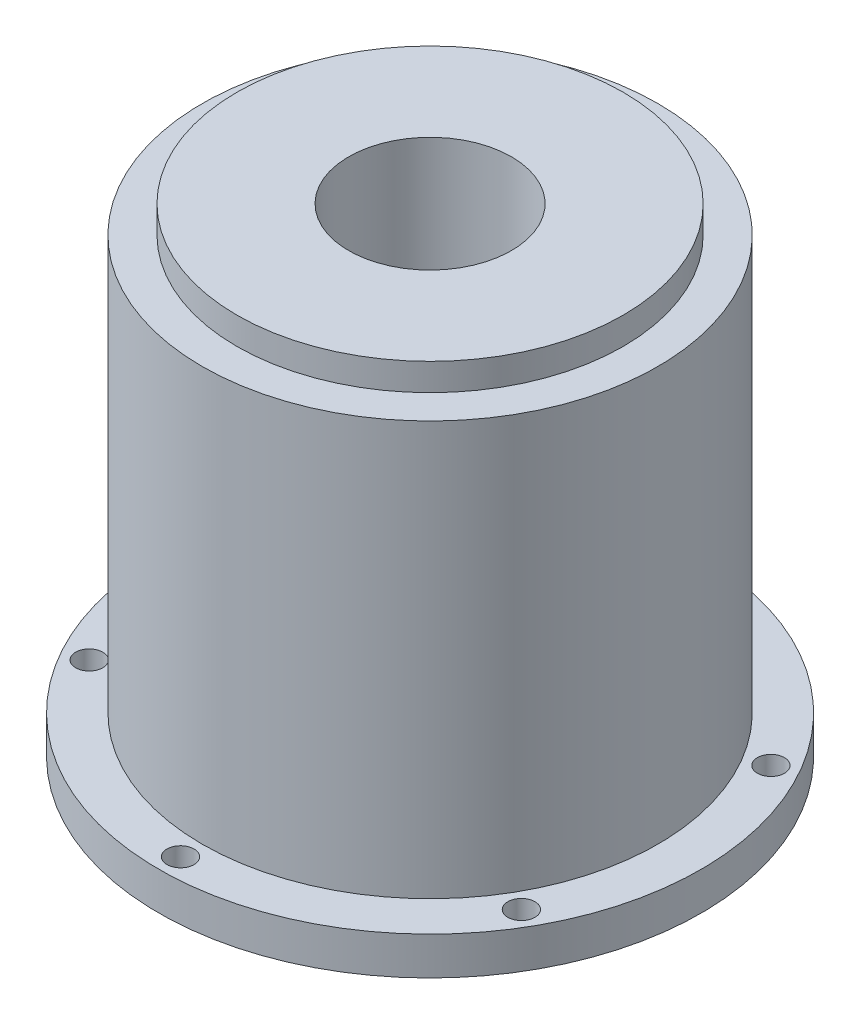
ISO-10303-21;
HEADER;
FILE_DESCRIPTION(('STEP AP214'),'2;1');
FILE_NAME('part.step','',(''),(''),'','','');
FILE_SCHEMA(('AUTOMOTIVE_DESIGN { 1 0 10303 214 1 1 1 1 }'));
ENDSEC;
DATA;
#1=APPLICATION_CONTEXT('core data for automotive mechanical design processes');
#2=APPLICATION_PROTOCOL_DEFINITION('international standard','automotive_design',2000,#1);
#3=PRODUCT_CONTEXT('',#1,'mechanical');
#4=PRODUCT('Part','Part','',(#3));
#5=PRODUCT_RELATED_PRODUCT_CATEGORY('part','',(#4));
#6=PRODUCT_DEFINITION_FORMATION('','',#4);
#7=PRODUCT_DEFINITION_CONTEXT('part definition',#1,'design');
#8=PRODUCT_DEFINITION('design','',#6,#7);
#9=PRODUCT_DEFINITION_SHAPE('','',#8);
#10=(LENGTH_UNIT() NAMED_UNIT(*) SI_UNIT(.MILLI.,.METRE.));
#11=(NAMED_UNIT(*) PLANE_ANGLE_UNIT() SI_UNIT($,.RADIAN.));
#12=(NAMED_UNIT(*) SI_UNIT($,.STERADIAN.) SOLID_ANGLE_UNIT());
#13=UNCERTAINTY_MEASURE_WITH_UNIT(LENGTH_MEASURE(1.E-05),#10,'distance_accuracy_value','');
#14=(GEOMETRIC_REPRESENTATION_CONTEXT(3) GLOBAL_UNCERTAINTY_ASSIGNED_CONTEXT((#13)) GLOBAL_UNIT_ASSIGNED_CONTEXT((#10,
#11,#12)) REPRESENTATION_CONTEXT('',''));
#15=CARTESIAN_POINT('',(0.,0.,0.));
#16=DIRECTION('',(0.,0.,1.));
#17=DIRECTION('',(1.,0.,0.));
#18=AXIS2_PLACEMENT_3D('',#15,#16,#17);
#19=CARTESIAN_POINT('',(0.,0.,0.));
#20=DIRECTION('',(0.,-1.,0.));
#21=DIRECTION('',(0.,0.,-1.));
#22=AXIS2_PLACEMENT_3D('',#19,#20,#21);
#23=CYLINDRICAL_SURFACE('',#22,8.7);
#24=CARTESIAN_POINT('',(0.,12.5168878123584,0.));
#25=DIRECTION('',(0.,-1.,0.));
#26=DIRECTION('',(0.,0.,-1.));
#27=AXIS2_PLACEMENT_3D('',#24,#25,#26);
#28=CIRCLE('',#27,8.7);
#29=CARTESIAN_POINT('',(0.,12.5168878123584,-8.7));
#30=VERTEX_POINT('',#29);
#31=EDGE_CURVE('E10',#30,#30,#28,.T.);
#32=ORIENTED_EDGE('',*,*,#31,.F.);
#33=EDGE_LOOP('',(#32));
#34=FACE_BOUND('',#33,.T.);
#35=CARTESIAN_POINT('',(0.,53.5218762730606,0.));
#36=DIRECTION('',(0.,-1.,0.));
#37=DIRECTION('',(0.,0.,-1.));
#38=AXIS2_PLACEMENT_3D('',#35,#36,#37);
#39=CIRCLE('',#38,8.7);
#40=CARTESIAN_POINT('',(0.,53.5218762730606,-8.7));
#41=VERTEX_POINT('',#40);
#42=EDGE_CURVE('E126',#41,#41,#39,.T.);
#43=ORIENTED_EDGE('',*,*,#42,.T.);
#44=EDGE_LOOP('',(#43));
#45=FACE_BOUND('',#44,.T.);
#46=ADVANCED_FACE('F37',(#34,#45),#23,.T.);
#47=CARTESIAN_POINT('',(13.1137702264527,12.5168878123584,0.));
#48=DIRECTION('',(0.,-1.,0.));
#49=DIRECTION('',(0.,0.,-1.));
#50=AXIS2_PLACEMENT_3D('',#47,#48,#49);
#51=PLANE('',#50);
#52=CARTESIAN_POINT('',(0.,12.5168878123584,-11.));
#53=DIRECTION('',(0.,1.,0.));
#54=DIRECTION('',(0.,0.,1.));
#55=AXIS2_PLACEMENT_3D('',#52,#53,#54);
#56=CIRCLE('',#55,1.25);
#57=CARTESIAN_POINT('',(0.,12.5168878123584,-9.75));
#58=VERTEX_POINT('',#57);
#59=EDGE_CURVE('E261',#58,#58,#56,.T.);
#60=ORIENTED_EDGE('',*,*,#59,.F.);
#61=EDGE_LOOP('',(#60));
#62=FACE_BOUND('',#61,.T.);
#63=CARTESIAN_POINT('',(-9.52627944162852,12.5168878123584,-5.49999999999945));
#64=DIRECTION('',(0.,1.,0.));
#65=DIRECTION('',(0.,0.,1.));
#66=AXIS2_PLACEMENT_3D('',#63,#64,#65);
#67=CIRCLE('',#66,1.25000000000059);
#68=CARTESIAN_POINT('',(-9.52627944162852,12.5168878123584,-4.24999999999887));
#69=VERTEX_POINT('',#68);
#70=EDGE_CURVE('E275',#69,#69,#67,.T.);
#71=ORIENTED_EDGE('',*,*,#70,.F.);
#72=EDGE_LOOP('',(#71));
#73=FACE_BOUND('',#72,.T.);
#74=CARTESIAN_POINT('',(-9.52627944162789,12.5168878123584,5.50000000000054));
#75=DIRECTION('',(0.,1.,0.));
#76=DIRECTION('',(0.,0.,1.));
#77=AXIS2_PLACEMENT_3D('',#74,#75,#76);
#78=CIRCLE('',#77,1.25000000000115);
#79=CARTESIAN_POINT('',(-9.52627944162789,12.5168878123584,6.7500000000017));
#80=VERTEX_POINT('',#79);
#81=EDGE_CURVE('E278',#80,#80,#78,.T.);
#82=ORIENTED_EDGE('',*,*,#81,.F.);
#83=EDGE_LOOP('',(#82));
#84=FACE_BOUND('',#83,.T.);
#85=CARTESIAN_POINT('',(1.24786099197965E-12,12.5168878123584,11.));
#86=DIRECTION('',(0.,1.,0.));
#87=DIRECTION('',(0.,0.,1.));
#88=AXIS2_PLACEMENT_3D('',#85,#86,#87);
#89=CIRCLE('',#88,1.25000000000127);
#90=CARTESIAN_POINT('',(1.24786099197965E-12,12.5168878123584,12.2500000000013));
#91=VERTEX_POINT('',#90);
#92=EDGE_CURVE('E283',#91,#91,#89,.T.);
#93=ORIENTED_EDGE('',*,*,#92,.F.);
#94=EDGE_LOOP('',(#93));
#95=FACE_BOUND('',#94,.T.);
#96=CARTESIAN_POINT('',(9.52627944162976,12.5168878123584,5.49999999999946));
#97=DIRECTION('',(0.,1.,0.));
#98=DIRECTION('',(0.,0.,1.));
#99=AXIS2_PLACEMENT_3D('',#96,#97,#98);
#100=CIRCLE('',#99,1.25000000000079);
#101=CARTESIAN_POINT('',(9.52627944162976,12.5168878123584,6.75000000000025));
#102=VERTEX_POINT('',#101);
#103=EDGE_CURVE('E272',#102,#102,#100,.T.);
#104=ORIENTED_EDGE('',*,*,#103,.F.);
#105=EDGE_LOOP('',(#104));
#106=FACE_BOUND('',#105,.T.);
#107=CARTESIAN_POINT('',(9.52627944162914,12.5168878123584,-5.50000000000054));
#108=DIRECTION('',(0.,1.,0.));
#109=DIRECTION('',(0.,0.,1.));
#110=AXIS2_PLACEMENT_3D('',#107,#108,#109);
#111=CIRCLE('',#110,1.25000000000016);
#112=CARTESIAN_POINT('',(9.52627944162914,12.5168878123584,-4.25000000000038));
#113=VERTEX_POINT('',#112);
#114=EDGE_CURVE('E264',#113,#113,#111,.T.);
#115=ORIENTED_EDGE('',*,*,#114,.F.);
#116=EDGE_LOOP('',(#115));
#117=FACE_BOUND('',#116,.T.);
#118=CARTESIAN_POINT('',(0.,12.5168878123584,0.));
#119=DIRECTION('',(0.,-1.,0.));
#120=DIRECTION('',(0.,0.,-1.));
#121=AXIS2_PLACEMENT_3D('',#118,#119,#120);
#122=CIRCLE('',#121,13.1137702264527);
#123=CARTESIAN_POINT('',(0.,12.5168878123584,-13.1137702264527));
#124=VERTEX_POINT('',#123);
#125=EDGE_CURVE('E45',#124,#124,#122,.T.);
#126=ORIENTED_EDGE('',*,*,#125,.F.);
#127=EDGE_LOOP('',(#126));
#128=FACE_BOUND('',#127,.T.);
#129=ORIENTED_EDGE('',*,*,#31,.T.);
#130=EDGE_LOOP('',(#129));
#131=FACE_BOUND('',#130,.T.);
#132=ADVANCED_FACE('F146',(#62,#73,#84,#95,#106,#117,#128,#131),#51,.F.);
#133=CARTESIAN_POINT('',(0.,0.,0.));
#134=DIRECTION('',(0.,-1.,0.));
#135=DIRECTION('',(0.,0.,-1.));
#136=AXIS2_PLACEMENT_3D('',#133,#134,#135);
#137=CYLINDRICAL_SURFACE('',#136,13.1137702264527);
#138=CARTESIAN_POINT('',(0.,15.9319356508298,0.));
#139=DIRECTION('',(0.,-1.,0.));
#140=DIRECTION('',(0.,0.,-1.));
#141=AXIS2_PLACEMENT_3D('',#138,#139,#140);
#142=CIRCLE('',#141,13.1137702264527);
#143=CARTESIAN_POINT('',(0.,15.9319356508298,-13.1137702264527));
#144=VERTEX_POINT('',#143);
#145=EDGE_CURVE('E51',#144,#144,#142,.T.);
#146=ORIENTED_EDGE('',*,*,#145,.F.);
#147=EDGE_LOOP('',(#146));
#148=FACE_BOUND('',#147,.T.);
#149=ORIENTED_EDGE('',*,*,#125,.T.);
#150=EDGE_LOOP('',(#149));
#151=FACE_BOUND('',#150,.T.);
#152=ADVANCED_FACE('F143',(#148,#151),#137,.F.);
#153=CARTESIAN_POINT('',(19.6,15.9319356508298,0.));
#154=DIRECTION('',(0.,-1.,0.));
#155=DIRECTION('',(0.,0.,-1.));
#156=AXIS2_PLACEMENT_3D('',#153,#154,#155);
#157=PLANE('',#156);
#158=CARTESIAN_POINT('',(0.,15.9319356508298,0.));
#159=DIRECTION('',(0.,-1.,0.));
#160=DIRECTION('',(0.,0.,-1.));
#161=AXIS2_PLACEMENT_3D('',#158,#159,#160);
#162=CIRCLE('',#161,19.6);
#163=CARTESIAN_POINT('',(0.,15.9319356508298,-19.6));
#164=VERTEX_POINT('',#163);
#165=EDGE_CURVE('E134',#164,#164,#162,.T.);
#166=ORIENTED_EDGE('',*,*,#165,.F.);
#167=EDGE_LOOP('',(#166));
#168=FACE_BOUND('',#167,.T.);
#169=ORIENTED_EDGE('',*,*,#145,.T.);
#170=EDGE_LOOP('',(#169));
#171=FACE_BOUND('',#170,.T.);
#172=ADVANCED_FACE('F141',(#168,#171),#157,.F.);
#173=CARTESIAN_POINT('',(0.,0.,0.));
#174=DIRECTION('',(0.,-1.,0.));
#175=DIRECTION('',(0.,0.,-1.));
#176=AXIS2_PLACEMENT_3D('',#173,#174,#175);
#177=CYLINDRICAL_SURFACE('',#176,19.6);
#178=CARTESIAN_POINT('',(0.,53.5218762730606,0.));
#179=DIRECTION('',(0.,-1.,0.));
#180=DIRECTION('',(0.,0.,-1.));
#181=AXIS2_PLACEMENT_3D('',#178,#179,#180);
#182=CIRCLE('',#181,19.6);
#183=CARTESIAN_POINT('',(0.,53.5218762730606,-19.6));
#184=VERTEX_POINT('',#183);
#185=EDGE_CURVE('E130',#184,#184,#182,.T.);
#186=ORIENTED_EDGE('',*,*,#185,.F.);
#187=EDGE_LOOP('',(#186));
#188=FACE_BOUND('',#187,.T.);
#189=ORIENTED_EDGE('',*,*,#165,.T.);
#190=EDGE_LOOP('',(#189));
#191=FACE_BOUND('',#190,.T.);
#192=ADVANCED_FACE('F161',(#188,#191),#177,.F.);
#193=CARTESIAN_POINT('',(8.7,53.5218762730606,0.));
#194=DIRECTION('',(0.,1.,0.));
#195=DIRECTION('',(0.,0.,1.));
#196=AXIS2_PLACEMENT_3D('',#193,#194,#195);
#197=PLANE('',#196);
#198=ORIENTED_EDGE('',*,*,#42,.F.);
#199=EDGE_LOOP('',(#198));
#200=FACE_BOUND('',#199,.T.);
#201=ORIENTED_EDGE('',*,*,#185,.T.);
#202=EDGE_LOOP('',(#201));
#203=FACE_BOUND('',#202,.T.);
#204=ADVANCED_FACE('F165',(#200,#203),#197,.F.);
#205=CARTESIAN_POINT('',(9.52627944162914,2.5168878123584,-5.50000000000054));
#206=DIRECTION('',(0.,1.,0.));
#207=DIRECTION('',(0.,0.,1.));
#208=AXIS2_PLACEMENT_3D('',#205,#206,#207);
#209=CYLINDRICAL_SURFACE('',#208,1.25000000000016);
#210=CARTESIAN_POINT('',(9.52627944162914,7.22187627306058,-5.50000000000054));
#211=DIRECTION('',(0.,-1.,0.));
#212=DIRECTION('',(0.,0.,-1.));
#213=AXIS2_PLACEMENT_3D('',#210,#211,#212);
#214=CIRCLE('',#213,1.25000000000016);
#215=CARTESIAN_POINT('',(9.52627944162914,7.22187627306058,-6.75000000000071));
#216=VERTEX_POINT('',#215);
#217=EDGE_CURVE('E263',#216,#216,#214,.T.);
#218=ORIENTED_EDGE('',*,*,#217,.T.);
#219=EDGE_LOOP('',(#218));
#220=FACE_BOUND('',#219,.T.);
#221=ORIENTED_EDGE('',*,*,#114,.T.);
#222=EDGE_LOOP('',(#221));
#223=FACE_BOUND('',#222,.T.);
#224=ADVANCED_FACE('F169',(#220,#223),#209,.F.);
#225=CARTESIAN_POINT('',(9.52627944162976,2.5168878123584,5.49999999999946));
#226=DIRECTION('',(0.,1.,0.));
#227=DIRECTION('',(0.,0.,1.));
#228=AXIS2_PLACEMENT_3D('',#225,#226,#227);
#229=CYLINDRICAL_SURFACE('',#228,1.25000000000079);
#230=CARTESIAN_POINT('',(9.52627944162976,7.22187627306058,5.49999999999946));
#231=DIRECTION('',(0.,-1.,0.));
#232=DIRECTION('',(0.,0.,-1.));
#233=AXIS2_PLACEMENT_3D('',#230,#231,#232);
#234=CIRCLE('',#233,1.25000000000079);
#235=CARTESIAN_POINT('',(9.52627944162976,7.22187627306058,4.24999999999867));
#236=VERTEX_POINT('',#235);
#237=EDGE_CURVE('E269',#236,#236,#234,.T.);
#238=ORIENTED_EDGE('',*,*,#237,.T.);
#239=EDGE_LOOP('',(#238));
#240=FACE_BOUND('',#239,.T.);
#241=ORIENTED_EDGE('',*,*,#103,.T.);
#242=EDGE_LOOP('',(#241));
#243=FACE_BOUND('',#242,.T.);
#244=ADVANCED_FACE('F241',(#240,#243),#229,.F.);
#245=CARTESIAN_POINT('',(1.24786099197965E-12,2.5168878123584,11.));
#246=DIRECTION('',(0.,1.,0.));
#247=DIRECTION('',(0.,0.,1.));
#248=AXIS2_PLACEMENT_3D('',#245,#246,#247);
#249=CYLINDRICAL_SURFACE('',#248,1.25000000000127);
#250=CARTESIAN_POINT('',(1.24786099197965E-12,7.22187627306058,11.));
#251=DIRECTION('',(0.,-1.,0.));
#252=DIRECTION('',(0.,0.,-1.));
#253=AXIS2_PLACEMENT_3D('',#250,#251,#252);
#254=CIRCLE('',#253,1.25000000000127);
#255=CARTESIAN_POINT('',(1.24786099197965E-12,7.22187627306058,9.74999999999873));
#256=VERTEX_POINT('',#255);
#257=EDGE_CURVE('E293',#256,#256,#254,.T.);
#258=ORIENTED_EDGE('',*,*,#257,.T.);
#259=EDGE_LOOP('',(#258));
#260=FACE_BOUND('',#259,.T.);
#261=ORIENTED_EDGE('',*,*,#92,.T.);
#262=EDGE_LOOP('',(#261));
#263=FACE_BOUND('',#262,.T.);
#264=ADVANCED_FACE('F237',(#260,#263),#249,.F.);
#265=CARTESIAN_POINT('',(-9.52627944162789,2.5168878123584,5.50000000000054));
#266=DIRECTION('',(0.,1.,0.));
#267=DIRECTION('',(0.,0.,1.));
#268=AXIS2_PLACEMENT_3D('',#265,#266,#267);
#269=CYLINDRICAL_SURFACE('',#268,1.25000000000115);
#270=CARTESIAN_POINT('',(-9.52627944162789,7.22187627306058,5.50000000000054));
#271=DIRECTION('',(0.,-1.,0.));
#272=DIRECTION('',(0.,0.,-1.));
#273=AXIS2_PLACEMENT_3D('',#270,#271,#272);
#274=CIRCLE('',#273,1.25000000000115);
#275=CARTESIAN_POINT('',(-9.52627944162789,7.22187627306058,4.24999999999939));
#276=VERTEX_POINT('',#275);
#277=EDGE_CURVE('E297',#276,#276,#274,.T.);
#278=ORIENTED_EDGE('',*,*,#277,.T.);
#279=EDGE_LOOP('',(#278));
#280=FACE_BOUND('',#279,.T.);
#281=ORIENTED_EDGE('',*,*,#81,.T.);
#282=EDGE_LOOP('',(#281));
#283=FACE_BOUND('',#282,.T.);
#284=ADVANCED_FACE('F233',(#280,#283),#269,.F.);
#285=CARTESIAN_POINT('',(-9.52627944162852,2.5168878123584,-5.49999999999945));
#286=DIRECTION('',(0.,1.,0.));
#287=DIRECTION('',(0.,0.,1.));
#288=AXIS2_PLACEMENT_3D('',#285,#286,#287);
#289=CYLINDRICAL_SURFACE('',#288,1.25000000000059);
#290=CARTESIAN_POINT('',(-9.52627944162852,7.22187627306058,-5.49999999999945));
#291=DIRECTION('',(0.,-1.,0.));
#292=DIRECTION('',(0.,0.,-1.));
#293=AXIS2_PLACEMENT_3D('',#290,#291,#292);
#294=CIRCLE('',#293,1.25000000000059);
#295=CARTESIAN_POINT('',(-9.52627944162852,7.22187627306058,-6.75000000000004));
#296=VERTEX_POINT('',#295);
#297=EDGE_CURVE('E301',#296,#296,#294,.T.);
#298=ORIENTED_EDGE('',*,*,#297,.T.);
#299=EDGE_LOOP('',(#298));
#300=FACE_BOUND('',#299,.T.);
#301=ORIENTED_EDGE('',*,*,#70,.T.);
#302=EDGE_LOOP('',(#301));
#303=FACE_BOUND('',#302,.T.);
#304=ADVANCED_FACE('F236',(#300,#303),#289,.F.);
#305=CARTESIAN_POINT('',(0.,2.5168878123584,-11.));
#306=DIRECTION('',(0.,1.,0.));
#307=DIRECTION('',(0.,0.,1.));
#308=AXIS2_PLACEMENT_3D('',#305,#306,#307);
#309=CYLINDRICAL_SURFACE('',#308,1.25);
#310=CARTESIAN_POINT('',(0.,7.22187627306058,-11.));
#311=DIRECTION('',(0.,-1.,0.));
#312=DIRECTION('',(0.,0.,-1.));
#313=AXIS2_PLACEMENT_3D('',#310,#311,#312);
#314=CIRCLE('',#313,1.25);
#315=CARTESIAN_POINT('',(0.,7.22187627306058,-12.25));
#316=VERTEX_POINT('',#315);
#317=EDGE_CURVE('E259',#316,#316,#314,.T.);
#318=ORIENTED_EDGE('',*,*,#317,.T.);
#319=EDGE_LOOP('',(#318));
#320=FACE_BOUND('',#319,.T.);
#321=ORIENTED_EDGE('',*,*,#59,.T.);
#322=EDGE_LOOP('',(#321));
#323=FACE_BOUND('',#322,.T.);
#324=ADVANCED_FACE('F175',(#320,#323),#309,.F.);
#325=CARTESIAN_POINT('',(7.5,57.8218762730606,0.));
#326=DIRECTION('',(0.,1.,0.));
#327=DIRECTION('',(0.,0.,1.));
#328=AXIS2_PLACEMENT_3D('',#325,#326,#327);
#329=PLANE('',#328);
#330=CARTESIAN_POINT('',(0.,57.8218762730606,0.));
#331=DIRECTION('',(0.,-1.,0.));
#332=DIRECTION('',(0.,0.,-1.));
#333=AXIS2_PLACEMENT_3D('',#330,#331,#332);
#334=CIRCLE('',#333,7.5);
#335=CARTESIAN_POINT('',(0.,57.8218762730606,-7.5));
#336=VERTEX_POINT('',#335);
#337=EDGE_CURVE('E78',#336,#336,#334,.T.);
#338=ORIENTED_EDGE('',*,*,#337,.T.);
#339=EDGE_LOOP('',(#338));
#340=FACE_BOUND('',#339,.T.);
#341=CARTESIAN_POINT('',(0.,57.8218762730606,0.));
#342=DIRECTION('',(0.,-1.,0.));
#343=DIRECTION('',(0.,0.,-1.));
#344=AXIS2_PLACEMENT_3D('',#341,#342,#343);
#345=CIRCLE('',#344,17.8017670559084);
#346=CARTESIAN_POINT('',(0.,57.8218762730606,-17.8017670559084));
#347=VERTEX_POINT('',#346);
#348=EDGE_CURVE('E122',#347,#347,#345,.T.);
#349=ORIENTED_EDGE('',*,*,#348,.F.);
#350=EDGE_LOOP('',(#349));
#351=FACE_BOUND('',#350,.T.);
#352=ADVANCED_FACE('F171',(#340,#351),#329,.T.);
#353=CARTESIAN_POINT('',(0.,0.,0.));
#354=DIRECTION('',(0.,-1.,0.));
#355=DIRECTION('',(0.,0.,-1.));
#356=AXIS2_PLACEMENT_3D('',#353,#354,#355);
#357=CYLINDRICAL_SURFACE('',#356,17.8017670559084);
#358=ORIENTED_EDGE('',*,*,#348,.T.);
#359=EDGE_LOOP('',(#358));
#360=FACE_BOUND('',#359,.T.);
#361=CARTESIAN_POINT('',(0.,55.3218762730606,0.));
#362=DIRECTION('',(0.,-1.,0.));
#363=DIRECTION('',(0.,0.,-1.));
#364=AXIS2_PLACEMENT_3D('',#361,#362,#363);
#365=CIRCLE('',#364,17.8017670559084);
#366=CARTESIAN_POINT('',(0.,55.3218762730606,-17.8017670559084));
#367=VERTEX_POINT('',#366);
#368=EDGE_CURVE('E118',#367,#367,#365,.T.);
#369=ORIENTED_EDGE('',*,*,#368,.F.);
#370=EDGE_LOOP('',(#369));
#371=FACE_BOUND('',#370,.T.);
#372=ADVANCED_FACE('F174',(#360,#371),#357,.T.);
#373=CARTESIAN_POINT('',(17.8017670559084,55.3218762730606,0.));
#374=DIRECTION('',(0.,1.,0.));
#375=DIRECTION('',(0.,0.,1.));
#376=AXIS2_PLACEMENT_3D('',#373,#374,#375);
#377=PLANE('',#376);
#378=ORIENTED_EDGE('',*,*,#368,.T.);
#379=EDGE_LOOP('',(#378));
#380=FACE_BOUND('',#379,.T.);
#381=CARTESIAN_POINT('',(0.,55.3218762730606,0.));
#382=DIRECTION('',(0.,-1.,0.));
#383=DIRECTION('',(0.,0.,-1.));
#384=AXIS2_PLACEMENT_3D('',#381,#382,#383);
#385=CIRCLE('',#384,21.);
#386=CARTESIAN_POINT('',(0.,55.3218762730606,-21.));
#387=VERTEX_POINT('',#386);
#388=EDGE_CURVE('E114',#387,#387,#385,.T.);
#389=ORIENTED_EDGE('',*,*,#388,.F.);
#390=EDGE_LOOP('',(#389));
#391=FACE_BOUND('',#390,.T.);
#392=ADVANCED_FACE('F178',(#380,#391),#377,.T.);
#393=CARTESIAN_POINT('',(0.,0.,0.));
#394=DIRECTION('',(0.,-1.,0.));
#395=DIRECTION('',(0.,0.,-1.));
#396=AXIS2_PLACEMENT_3D('',#393,#394,#395);
#397=CYLINDRICAL_SURFACE('',#396,21.);
#398=ORIENTED_EDGE('',*,*,#388,.T.);
#399=EDGE_LOOP('',(#398));
#400=FACE_BOUND('',#399,.T.);
#401=CARTESIAN_POINT('',(0.,17.1864239426177,0.));
#402=DIRECTION('',(0.,-1.,0.));
#403=DIRECTION('',(0.,0.,-1.));
#404=AXIS2_PLACEMENT_3D('',#401,#402,#403);
#405=CIRCLE('',#404,21.);
#406=CARTESIAN_POINT('',(0.,17.1864239426177,-21.));
#407=VERTEX_POINT('',#406);
#408=EDGE_CURVE('E110',#407,#407,#405,.T.);
#409=ORIENTED_EDGE('',*,*,#408,.F.);
#410=EDGE_LOOP('',(#409));
#411=FACE_BOUND('',#410,.T.);
#412=ADVANCED_FACE('F182',(#400,#411),#397,.T.);
#413=CARTESIAN_POINT('',(21.,17.1864239426177,0.));
#414=DIRECTION('',(0.,1.,0.));
#415=DIRECTION('',(0.,0.,1.));
#416=AXIS2_PLACEMENT_3D('',#413,#414,#415);
#417=PLANE('',#416);
#418=CARTESIAN_POINT('',(0.,17.1864239426177,-23.));
#419=DIRECTION('',(0.,1.,0.));
#420=DIRECTION('',(0.,0.,1.));
#421=AXIS2_PLACEMENT_3D('',#418,#419,#420);
#422=CIRCLE('',#421,1.25);
#423=CARTESIAN_POINT('',(0.,17.1864239426177,-21.75));
#424=VERTEX_POINT('',#423);
#425=EDGE_CURVE('E60',#424,#424,#422,.T.);
#426=ORIENTED_EDGE('',*,*,#425,.F.);
#427=EDGE_LOOP('',(#426));
#428=FACE_BOUND('',#427,.T.);
#429=CARTESIAN_POINT('',(-19.9185842870405,17.1864239426177,-11.4999999999972));
#430=DIRECTION('',(0.,1.,0.));
#431=DIRECTION('',(0.,0.,1.));
#432=AXIS2_PLACEMENT_3D('',#429,#430,#431);
#433=CIRCLE('',#432,1.25000000000266);
#434=CARTESIAN_POINT('',(-19.9185842870405,17.1864239426177,-10.2499999999945));
#435=VERTEX_POINT('',#434);
#436=EDGE_CURVE('E307',#435,#435,#433,.T.);
#437=ORIENTED_EDGE('',*,*,#436,.F.);
#438=EDGE_LOOP('',(#437));
#439=FACE_BOUND('',#438,.T.);
#440=CARTESIAN_POINT('',(-19.9185842870372,17.1864239426177,11.5000000000028));
#441=DIRECTION('',(0.,1.,0.));
#442=DIRECTION('',(0.,0.,1.));
#443=AXIS2_PLACEMENT_3D('',#440,#441,#442);
#444=CIRCLE('',#443,1.25000000000572);
#445=CARTESIAN_POINT('',(-19.9185842870372,17.1864239426177,12.7500000000086));
#446=VERTEX_POINT('',#445);
#447=EDGE_CURVE('E92',#446,#446,#444,.T.);
#448=ORIENTED_EDGE('',*,*,#447,.F.);
#449=EDGE_LOOP('',(#448));
#450=FACE_BOUND('',#449,.T.);
#451=CARTESIAN_POINT('',(6.53135979371684E-12,17.1864239426177,23.));
#452=DIRECTION('',(0.,1.,0.));
#453=DIRECTION('',(0.,0.,1.));
#454=AXIS2_PLACEMENT_3D('',#451,#452,#453);
#455=CIRCLE('',#454,1.2500000000064);
#456=CARTESIAN_POINT('',(6.53135979371684E-12,17.1864239426177,24.2500000000064));
#457=VERTEX_POINT('',#456);
#458=EDGE_CURVE('E321',#457,#457,#455,.T.);
#459=ORIENTED_EDGE('',*,*,#458,.F.);
#460=EDGE_LOOP('',(#459));
#461=FACE_BOUND('',#460,.T.);
#462=CARTESIAN_POINT('',(19.918584287047,17.1864239426177,11.4999999999972));
#463=DIRECTION('',(0.,1.,0.));
#464=DIRECTION('',(0.,0.,1.));
#465=AXIS2_PLACEMENT_3D('',#462,#463,#464);
#466=CIRCLE('',#465,1.25000000000396);
#467=CARTESIAN_POINT('',(19.918584287047,17.1864239426177,12.7500000000011));
#468=VERTEX_POINT('',#467);
#469=EDGE_CURVE('E318',#468,#468,#466,.T.);
#470=ORIENTED_EDGE('',*,*,#469,.F.);
#471=EDGE_LOOP('',(#470));
#472=FACE_BOUND('',#471,.T.);
#473=CARTESIAN_POINT('',(19.9185842870437,17.1864239426177,-11.5000000000028));
#474=DIRECTION('',(0.,1.,0.));
#475=DIRECTION('',(0.,0.,1.));
#476=AXIS2_PLACEMENT_3D('',#473,#474,#475);
#477=CIRCLE('',#476,1.25000000000079);
#478=CARTESIAN_POINT('',(19.9185842870437,17.1864239426177,-10.250000000002));
#479=VERTEX_POINT('',#478);
#480=EDGE_CURVE('E311',#479,#479,#477,.T.);
#481=ORIENTED_EDGE('',*,*,#480,.F.);
#482=EDGE_LOOP('',(#481));
#483=FACE_BOUND('',#482,.T.);
#484=ORIENTED_EDGE('',*,*,#408,.T.);
#485=EDGE_LOOP('',(#484));
#486=FACE_BOUND('',#485,.T.);
#487=CARTESIAN_POINT('',(0.,17.1864239426177,0.));
#488=DIRECTION('',(0.,-1.,0.));
#489=DIRECTION('',(0.,0.,-1.));
#490=AXIS2_PLACEMENT_3D('',#487,#488,#489);
#491=CIRCLE('',#490,25.);
#492=CARTESIAN_POINT('',(0.,17.1864239426177,-25.));
#493=VERTEX_POINT('',#492);
#494=EDGE_CURVE('E106',#493,#493,#491,.T.);
#495=ORIENTED_EDGE('',*,*,#494,.F.);
#496=EDGE_LOOP('',(#495));
#497=FACE_BOUND('',#496,.T.);
#498=ADVANCED_FACE('F186',(#428,#439,#450,#461,#472,#483,#486,#497),#417,.T.);
#499=CARTESIAN_POINT('',(0.,0.,0.));
#500=DIRECTION('',(0.,-1.,0.));
#501=DIRECTION('',(0.,0.,-1.));
#502=AXIS2_PLACEMENT_3D('',#499,#500,#501);
#503=CYLINDRICAL_SURFACE('',#502,25.);
#504=ORIENTED_EDGE('',*,*,#494,.T.);
#505=EDGE_LOOP('',(#504));
#506=FACE_BOUND('',#505,.T.);
#507=CARTESIAN_POINT('',(0.,13.6864239426177,0.));
#508=DIRECTION('',(0.,-1.,0.));
#509=DIRECTION('',(0.,0.,-1.));
#510=AXIS2_PLACEMENT_3D('',#507,#508,#509);
#511=CIRCLE('',#510,25.);
#512=CARTESIAN_POINT('',(0.,13.6864239426177,-25.));
#513=VERTEX_POINT('',#512);
#514=EDGE_CURVE('E102',#513,#513,#511,.T.);
#515=ORIENTED_EDGE('',*,*,#514,.F.);
#516=EDGE_LOOP('',(#515));
#517=FACE_BOUND('',#516,.T.);
#518=ADVANCED_FACE('F190',(#506,#517),#503,.T.);
#519=CARTESIAN_POINT('',(25.,13.6864239426177,0.));
#520=DIRECTION('',(0.,-1.,0.));
#521=DIRECTION('',(0.,0.,-1.));
#522=AXIS2_PLACEMENT_3D('',#519,#520,#521);
#523=PLANE('',#522);
#524=CARTESIAN_POINT('',(0.,13.6864239426177,-23.));
#525=DIRECTION('',(0.,-1.,0.));
#526=DIRECTION('',(0.,0.,-1.));
#527=AXIS2_PLACEMENT_3D('',#524,#525,#526);
#528=CIRCLE('',#527,1.25);
#529=CARTESIAN_POINT('',(0.,13.6864239426177,-24.25));
#530=VERTEX_POINT('',#529);
#531=EDGE_CURVE('E40',#530,#530,#528,.T.);
#532=ORIENTED_EDGE('',*,*,#531,.F.);
#533=EDGE_LOOP('',(#532));
#534=FACE_BOUND('',#533,.T.);
#535=CARTESIAN_POINT('',(-19.9185842870405,13.6864239426177,-11.4999999999972));
#536=DIRECTION('',(0.,-1.,0.));
#537=DIRECTION('',(0.,0.,-1.));
#538=AXIS2_PLACEMENT_3D('',#535,#536,#537);
#539=CIRCLE('',#538,1.25000000000266);
#540=CARTESIAN_POINT('',(-19.9185842870405,13.6864239426177,-12.7499999999998));
#541=VERTEX_POINT('',#540);
#542=EDGE_CURVE('E71',#541,#541,#539,.T.);
#543=ORIENTED_EDGE('',*,*,#542,.F.);
#544=EDGE_LOOP('',(#543));
#545=FACE_BOUND('',#544,.T.);
#546=CARTESIAN_POINT('',(-19.9185842870372,13.6864239426177,11.5000000000028));
#547=DIRECTION('',(0.,-1.,0.));
#548=DIRECTION('',(0.,0.,-1.));
#549=AXIS2_PLACEMENT_3D('',#546,#547,#548);
#550=CIRCLE('',#549,1.25000000000572);
#551=CARTESIAN_POINT('',(-19.9185842870372,13.6864239426177,10.2499999999971));
#552=VERTEX_POINT('',#551);
#553=EDGE_CURVE('E68',#552,#552,#550,.T.);
#554=ORIENTED_EDGE('',*,*,#553,.F.);
#555=EDGE_LOOP('',(#554));
#556=FACE_BOUND('',#555,.T.);
#557=CARTESIAN_POINT('',(6.53135979371684E-12,13.6864239426177,23.));
#558=DIRECTION('',(0.,-1.,0.));
#559=DIRECTION('',(0.,0.,-1.));
#560=AXIS2_PLACEMENT_3D('',#557,#558,#559);
#561=CIRCLE('',#560,1.2500000000064);
#562=CARTESIAN_POINT('',(6.53135979371684E-12,13.6864239426177,21.7499999999936));
#563=VERTEX_POINT('',#562);
#564=EDGE_CURVE('E64',#563,#563,#561,.T.);
#565=ORIENTED_EDGE('',*,*,#564,.F.);
#566=EDGE_LOOP('',(#565));
#567=FACE_BOUND('',#566,.T.);
#568=CARTESIAN_POINT('',(19.918584287047,13.6864239426177,11.4999999999972));
#569=DIRECTION('',(0.,-1.,0.));
#570=DIRECTION('',(0.,0.,-1.));
#571=AXIS2_PLACEMENT_3D('',#568,#569,#570);
#572=CIRCLE('',#571,1.25000000000396);
#573=CARTESIAN_POINT('',(19.918584287047,13.6864239426177,10.2499999999932));
#574=VERTEX_POINT('',#573);
#575=EDGE_CURVE('E59',#574,#574,#572,.T.);
#576=ORIENTED_EDGE('',*,*,#575,.F.);
#577=EDGE_LOOP('',(#576));
#578=FACE_BOUND('',#577,.T.);
#579=CARTESIAN_POINT('',(19.9185842870437,13.6864239426177,-11.5000000000028));
#580=DIRECTION('',(0.,-1.,0.));
#581=DIRECTION('',(0.,0.,-1.));
#582=AXIS2_PLACEMENT_3D('',#579,#580,#581);
#583=CIRCLE('',#582,1.25000000000079);
#584=CARTESIAN_POINT('',(19.9185842870437,13.6864239426177,-12.7500000000036));
#585=VERTEX_POINT('',#584);
#586=EDGE_CURVE('E55',#585,#585,#583,.T.);
#587=ORIENTED_EDGE('',*,*,#586,.F.);
#588=EDGE_LOOP('',(#587));
#589=FACE_BOUND('',#588,.T.);
#590=ORIENTED_EDGE('',*,*,#514,.T.);
#591=EDGE_LOOP('',(#590));
#592=FACE_BOUND('',#591,.T.);
#593=CARTESIAN_POINT('',(0.,13.6864239426177,0.));
#594=DIRECTION('',(0.,-1.,0.));
#595=DIRECTION('',(0.,0.,-1.));
#596=AXIS2_PLACEMENT_3D('',#593,#594,#595);
#597=CIRCLE('',#596,15.);
#598=CARTESIAN_POINT('',(0.,13.6864239426177,-15.));
#599=VERTEX_POINT('',#598);
#600=EDGE_CURVE('E98',#599,#599,#597,.T.);
#601=ORIENTED_EDGE('',*,*,#600,.F.);
#602=EDGE_LOOP('',(#601));
#603=FACE_BOUND('',#602,.T.);
#604=ADVANCED_FACE('F194',(#534,#545,#556,#567,#578,#589,#592,#603),#523,.T.);
#605=CARTESIAN_POINT('',(0.,0.,0.));
#606=DIRECTION('',(0.,-1.,0.));
#607=DIRECTION('',(0.,0.,-1.));
#608=AXIS2_PLACEMENT_3D('',#605,#606,#607);
#609=CYLINDRICAL_SURFACE('',#608,15.);
#610=ORIENTED_EDGE('',*,*,#600,.T.);
#611=EDGE_LOOP('',(#610));
#612=FACE_BOUND('',#611,.T.);
#613=CARTESIAN_POINT('',(0.,7.22187627306058,0.));
#614=DIRECTION('',(0.,-1.,0.));
#615=DIRECTION('',(0.,0.,-1.));
#616=AXIS2_PLACEMENT_3D('',#613,#614,#615);
#617=CIRCLE('',#616,15.);
#618=CARTESIAN_POINT('',(0.,7.22187627306058,-15.));
#619=VERTEX_POINT('',#618);
#620=EDGE_CURVE('E89',#619,#619,#617,.T.);
#621=ORIENTED_EDGE('',*,*,#620,.F.);
#622=EDGE_LOOP('',(#621));
#623=FACE_BOUND('',#622,.T.);
#624=ADVANCED_FACE('F198',(#612,#623),#609,.T.);
#625=CARTESIAN_POINT('',(15.,7.22187627306058,0.));
#626=DIRECTION('',(0.,-1.,0.));
#627=DIRECTION('',(0.,0.,-1.));
#628=AXIS2_PLACEMENT_3D('',#625,#626,#627);
#629=PLANE('',#628);
#630=ORIENTED_EDGE('',*,*,#317,.F.);
#631=EDGE_LOOP('',(#630));
#632=FACE_BOUND('',#631,.T.);
#633=ORIENTED_EDGE('',*,*,#297,.F.);
#634=EDGE_LOOP('',(#633));
#635=FACE_BOUND('',#634,.T.);
#636=ORIENTED_EDGE('',*,*,#277,.F.);
#637=EDGE_LOOP('',(#636));
#638=FACE_BOUND('',#637,.T.);
#639=ORIENTED_EDGE('',*,*,#257,.F.);
#640=EDGE_LOOP('',(#639));
#641=FACE_BOUND('',#640,.T.);
#642=ORIENTED_EDGE('',*,*,#237,.F.);
#643=EDGE_LOOP('',(#642));
#644=FACE_BOUND('',#643,.T.);
#645=ORIENTED_EDGE('',*,*,#217,.F.);
#646=EDGE_LOOP('',(#645));
#647=FACE_BOUND('',#646,.T.);
#648=ORIENTED_EDGE('',*,*,#620,.T.);
#649=EDGE_LOOP('',(#648));
#650=FACE_BOUND('',#649,.T.);
#651=CARTESIAN_POINT('',(0.,7.22187627306058,0.));
#652=DIRECTION('',(0.,-1.,0.));
#653=DIRECTION('',(0.,0.,-1.));
#654=AXIS2_PLACEMENT_3D('',#651,#652,#653);
#655=CIRCLE('',#654,7.50000000000001);
#656=CARTESIAN_POINT('',(0.,7.22187627306058,-7.50000000000001));
#657=VERTEX_POINT('',#656);
#658=EDGE_CURVE('E83',#657,#657,#655,.T.);
#659=ORIENTED_EDGE('',*,*,#658,.F.);
#660=EDGE_LOOP('',(#659));
#661=FACE_BOUND('',#660,.T.);
#662=ADVANCED_FACE('F202',(#632,#635,#638,#641,#644,#647,#650,#661),#629,.T.);
#663=CARTESIAN_POINT('',(0.,0.,0.));
#664=DIRECTION('',(0.,-1.,0.));
#665=DIRECTION('',(0.,0.,-1.));
#666=AXIS2_PLACEMENT_3D('',#663,#664,#665);
#667=CYLINDRICAL_SURFACE('',#666,7.5);
#668=ORIENTED_EDGE('',*,*,#658,.T.);
#669=EDGE_LOOP('',(#668));
#670=FACE_BOUND('',#669,.T.);
#671=ORIENTED_EDGE('',*,*,#337,.F.);
#672=EDGE_LOOP('',(#671));
#673=FACE_BOUND('',#672,.T.);
#674=ADVANCED_FACE('F206',(#670,#673),#667,.F.);
#675=CARTESIAN_POINT('',(19.9185842870437,7.18642394261767,-11.5000000000028));
#676=DIRECTION('',(0.,1.,0.));
#677=DIRECTION('',(0.,0.,1.));
#678=AXIS2_PLACEMENT_3D('',#675,#676,#677);
#679=CYLINDRICAL_SURFACE('',#678,1.25000000000079);
#680=ORIENTED_EDGE('',*,*,#586,.T.);
#681=EDGE_LOOP('',(#680));
#682=FACE_BOUND('',#681,.T.);
#683=ORIENTED_EDGE('',*,*,#480,.T.);
#684=EDGE_LOOP('',(#683));
#685=FACE_BOUND('',#684,.T.);
#686=ADVANCED_FACE('F210',(#682,#685),#679,.F.);
#687=CARTESIAN_POINT('',(19.918584287047,7.18642394261767,11.4999999999972));
#688=DIRECTION('',(0.,1.,0.));
#689=DIRECTION('',(0.,0.,1.));
#690=AXIS2_PLACEMENT_3D('',#687,#688,#689);
#691=CYLINDRICAL_SURFACE('',#690,1.25000000000396);
#692=ORIENTED_EDGE('',*,*,#575,.T.);
#693=EDGE_LOOP('',(#692));
#694=FACE_BOUND('',#693,.T.);
#695=ORIENTED_EDGE('',*,*,#469,.T.);
#696=EDGE_LOOP('',(#695));
#697=FACE_BOUND('',#696,.T.);
#698=ADVANCED_FACE('F220',(#694,#697),#691,.F.);
#699=CARTESIAN_POINT('',(6.53135979371684E-12,7.18642394261767,23.));
#700=DIRECTION('',(0.,1.,0.));
#701=DIRECTION('',(0.,0.,1.));
#702=AXIS2_PLACEMENT_3D('',#699,#700,#701);
#703=CYLINDRICAL_SURFACE('',#702,1.2500000000064);
#704=ORIENTED_EDGE('',*,*,#564,.T.);
#705=EDGE_LOOP('',(#704));
#706=FACE_BOUND('',#705,.T.);
#707=ORIENTED_EDGE('',*,*,#458,.T.);
#708=EDGE_LOOP('',(#707));
#709=FACE_BOUND('',#708,.T.);
#710=ADVANCED_FACE('F216',(#706,#709),#703,.F.);
#711=CARTESIAN_POINT('',(-19.9185842870372,7.18642394261767,11.5000000000028));
#712=DIRECTION('',(0.,1.,0.));
#713=DIRECTION('',(0.,0.,1.));
#714=AXIS2_PLACEMENT_3D('',#711,#712,#713);
#715=CYLINDRICAL_SURFACE('',#714,1.25000000000572);
#716=ORIENTED_EDGE('',*,*,#553,.T.);
#717=EDGE_LOOP('',(#716));
#718=FACE_BOUND('',#717,.T.);
#719=ORIENTED_EDGE('',*,*,#447,.T.);
#720=EDGE_LOOP('',(#719));
#721=FACE_BOUND('',#720,.T.);
#722=ADVANCED_FACE('F212',(#718,#721),#715,.F.);
#723=CARTESIAN_POINT('',(-19.9185842870405,7.18642394261767,-11.4999999999972));
#724=DIRECTION('',(0.,1.,0.));
#725=DIRECTION('',(0.,0.,1.));
#726=AXIS2_PLACEMENT_3D('',#723,#724,#725);
#727=CYLINDRICAL_SURFACE('',#726,1.25000000000266);
#728=ORIENTED_EDGE('',*,*,#542,.T.);
#729=EDGE_LOOP('',(#728));
#730=FACE_BOUND('',#729,.T.);
#731=ORIENTED_EDGE('',*,*,#436,.T.);
#732=EDGE_LOOP('',(#731));
#733=FACE_BOUND('',#732,.T.);
#734=ADVANCED_FACE('F215',(#730,#733),#727,.F.);
#735=CARTESIAN_POINT('',(0.,7.18642394261767,-23.));
#736=DIRECTION('',(0.,1.,0.));
#737=DIRECTION('',(0.,0.,1.));
#738=AXIS2_PLACEMENT_3D('',#735,#736,#737);
#739=CYLINDRICAL_SURFACE('',#738,1.25);
#740=ORIENTED_EDGE('',*,*,#531,.T.);
#741=EDGE_LOOP('',(#740));
#742=FACE_BOUND('',#741,.T.);
#743=ORIENTED_EDGE('',*,*,#425,.T.);
#744=EDGE_LOOP('',(#743));
#745=FACE_BOUND('',#744,.T.);
#746=ADVANCED_FACE('F230',(#742,#745),#739,.F.);
#747=CLOSED_SHELL('',(#46,#132,#152,#172,#192,#204,#224,#244,#264,#284,#304,#324,#352,#372,#392,
#412,#498,#518,#604,#624,#662,#674,#686,#698,#710,#722,#734,#746));
#748=MANIFOLD_SOLID_BREP('B2',#747);
#749=ADVANCED_BREP_SHAPE_REPRESENTATION('',(#18,#748),#14);
#750=SHAPE_DEFINITION_REPRESENTATION(#9,#749);
ENDSEC;
END-ISO-10303-21;
